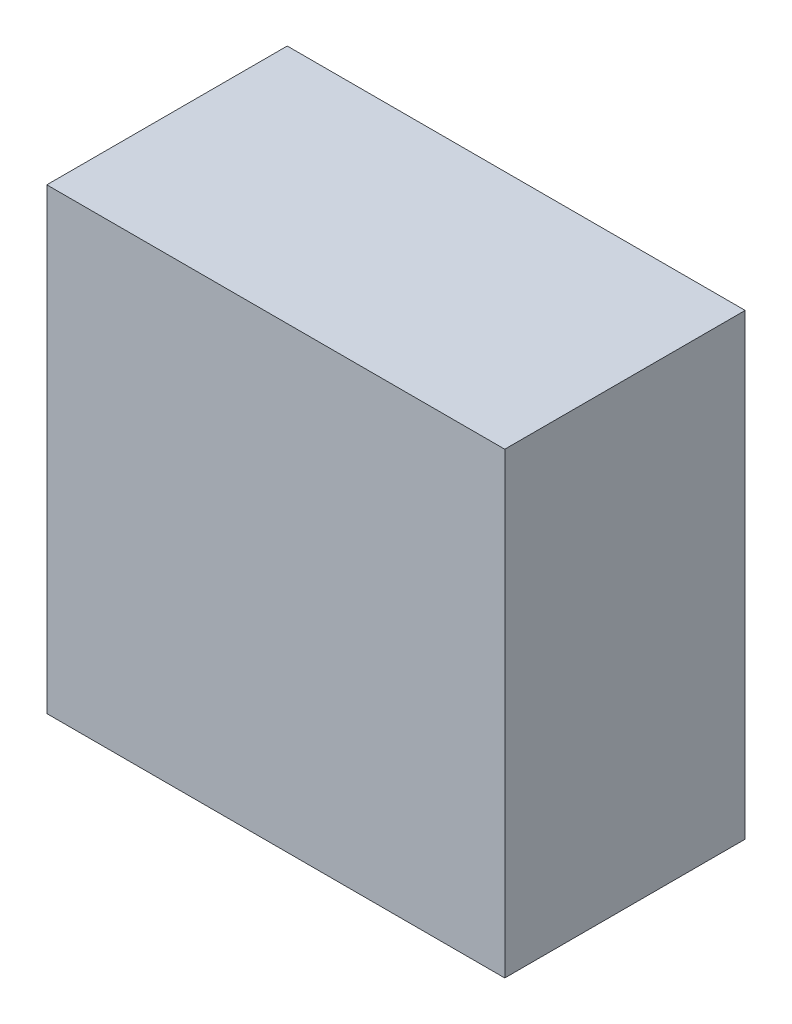
ISO-10303-21;
HEADER;
FILE_DESCRIPTION(('STEP AP214'),'2;1');
FILE_NAME('part.step','',(''),(''),'','','');
FILE_SCHEMA(('AUTOMOTIVE_DESIGN { 1 0 10303 214 1 1 1 1 }'));
ENDSEC;
DATA;
#1=APPLICATION_CONTEXT('core data for automotive mechanical design processes');
#2=APPLICATION_PROTOCOL_DEFINITION('international standard','automotive_design',2000,#1);
#3=PRODUCT_CONTEXT('',#1,'mechanical');
#4=PRODUCT('Part','Part','',(#3));
#5=PRODUCT_RELATED_PRODUCT_CATEGORY('part','',(#4));
#6=PRODUCT_DEFINITION_FORMATION('','',#4);
#7=PRODUCT_DEFINITION_CONTEXT('part definition',#1,'design');
#8=PRODUCT_DEFINITION('design','',#6,#7);
#9=PRODUCT_DEFINITION_SHAPE('','',#8);
#10=(LENGTH_UNIT() NAMED_UNIT(*) SI_UNIT(.MILLI.,.METRE.));
#11=(NAMED_UNIT(*) PLANE_ANGLE_UNIT() SI_UNIT($,.RADIAN.));
#12=(NAMED_UNIT(*) SI_UNIT($,.STERADIAN.) SOLID_ANGLE_UNIT());
#13=UNCERTAINTY_MEASURE_WITH_UNIT(LENGTH_MEASURE(1.E-05),#10,'distance_accuracy_value','');
#14=(GEOMETRIC_REPRESENTATION_CONTEXT(3) GLOBAL_UNCERTAINTY_ASSIGNED_CONTEXT((#13)) GLOBAL_UNIT_ASSIGNED_CONTEXT((#10,
#11,#12)) REPRESENTATION_CONTEXT('',''));
#15=CARTESIAN_POINT('',(0.,0.,0.));
#16=DIRECTION('',(0.,0.,1.));
#17=DIRECTION('',(1.,0.,0.));
#18=AXIS2_PLACEMENT_3D('',#15,#16,#17);
#19=CARTESIAN_POINT('',(2.00000108,-2.00000108,2.10000088));
#20=DIRECTION('',(0.,0.,-1.));
#21=DIRECTION('',(-1.,0.,0.));
#22=AXIS2_PLACEMENT_3D('',#19,#20,#21);
#23=PLANE('',#22);
#24=DIRECTION('',(1.,0.,0.));
#25=VECTOR('',#24,1.);
#26=CARTESIAN_POINT('',(2.00000108,2.00000108,2.10000088));
#27=LINE('',#26,#25);
#28=CARTESIAN_POINT('',(2.00000108,2.00000108,2.10000088));
#29=VERTEX_POINT('',#28);
#30=CARTESIAN_POINT('',(-2.00000108,2.00000108,2.10000088));
#31=VERTEX_POINT('',#30);
#32=EDGE_CURVE('E55',#29,#31,#27,.F.);
#33=ORIENTED_EDGE('',*,*,#32,.T.);
#34=DIRECTION('',(0.,1.,0.));
#35=VECTOR('',#34,1.);
#36=CARTESIAN_POINT('',(-2.00000108,2.00000108,2.10000088));
#37=LINE('',#36,#35);
#38=CARTESIAN_POINT('',(-2.00000108,-2.00000108,2.10000088));
#39=VERTEX_POINT('',#38);
#40=EDGE_CURVE('E57',#31,#39,#37,.F.);
#41=ORIENTED_EDGE('',*,*,#40,.T.);
#42=DIRECTION('',(1.,0.,0.));
#43=VECTOR('',#42,1.);
#44=CARTESIAN_POINT('',(-2.00000108,-2.00000108,2.10000088));
#45=LINE('',#44,#43);
#46=CARTESIAN_POINT('',(2.00000108,-2.00000108,2.10000088));
#47=VERTEX_POINT('',#46);
#48=EDGE_CURVE('E20',#39,#47,#45,.T.);
#49=ORIENTED_EDGE('',*,*,#48,.T.);
#50=DIRECTION('',(0.,1.,0.));
#51=VECTOR('',#50,1.);
#52=CARTESIAN_POINT('',(2.00000108,-2.00000108,2.10000088));
#53=LINE('',#52,#51);
#54=EDGE_CURVE('E80',#47,#29,#53,.T.);
#55=ORIENTED_EDGE('',*,*,#54,.T.);
#56=EDGE_LOOP('',(#33,#41,#49,#55));
#57=FACE_BOUND('',#56,.T.);
#58=ADVANCED_FACE('F17',(#57),#23,.F.);
#59=CARTESIAN_POINT('',(-2.00000108,-2.00000108,0.));
#60=DIRECTION('',(0.,1.,0.));
#61=DIRECTION('',(0.,0.,1.));
#62=AXIS2_PLACEMENT_3D('',#59,#60,#61);
#63=PLANE('',#62);
#64=DIRECTION('',(0.,0.,1.));
#65=VECTOR('',#64,1.);
#66=CARTESIAN_POINT('',(2.00000108,-2.00000108,0.));
#67=LINE('',#66,#65);
#68=CARTESIAN_POINT('',(2.00000108,-2.00000108,0.));
#69=VERTEX_POINT('',#68);
#70=EDGE_CURVE('E68',#69,#47,#67,.T.);
#71=ORIENTED_EDGE('',*,*,#70,.T.);
#72=ORIENTED_EDGE('',*,*,#48,.F.);
#73=DIRECTION('',(0.,0.,-1.));
#74=VECTOR('',#73,1.);
#75=CARTESIAN_POINT('',(-2.00000108,-2.00000108,0.));
#76=LINE('',#75,#74);
#77=CARTESIAN_POINT('',(-2.00000108,-2.00000108,0.));
#78=VERTEX_POINT('',#77);
#79=EDGE_CURVE('E63',#39,#78,#76,.T.);
#80=ORIENTED_EDGE('',*,*,#79,.T.);
#81=DIRECTION('',(-1.,0.,0.));
#82=VECTOR('',#81,1.);
#83=CARTESIAN_POINT('',(2.00000108,-2.00000108,0.));
#84=LINE('',#83,#82);
#85=EDGE_CURVE('E83',#69,#78,#84,.T.);
#86=ORIENTED_EDGE('',*,*,#85,.F.);
#87=EDGE_LOOP('',(#71,#72,#80,#86));
#88=FACE_BOUND('',#87,.T.);
#89=ADVANCED_FACE('F65',(#88),#63,.F.);
#90=CARTESIAN_POINT('',(-2.00000108,2.00000108,0.));
#91=DIRECTION('',(1.,0.,0.));
#92=DIRECTION('',(0.,0.,-1.));
#93=AXIS2_PLACEMENT_3D('',#90,#91,#92);
#94=PLANE('',#93);
#95=ORIENTED_EDGE('',*,*,#79,.F.);
#96=ORIENTED_EDGE('',*,*,#40,.F.);
#97=DIRECTION('',(0.,0.,-1.));
#98=VECTOR('',#97,1.);
#99=CARTESIAN_POINT('',(-2.00000108,2.00000108,0.));
#100=LINE('',#99,#98);
#101=CARTESIAN_POINT('',(-2.00000108,2.00000108,0.));
#102=VERTEX_POINT('',#101);
#103=EDGE_CURVE('E75',#31,#102,#100,.T.);
#104=ORIENTED_EDGE('',*,*,#103,.T.);
#105=DIRECTION('',(0.,1.,0.));
#106=VECTOR('',#105,1.);
#107=CARTESIAN_POINT('',(-2.00000108,-2.00000108,0.));
#108=LINE('',#107,#106);
#109=EDGE_CURVE('E72',#78,#102,#108,.T.);
#110=ORIENTED_EDGE('',*,*,#109,.F.);
#111=EDGE_LOOP('',(#95,#96,#104,#110));
#112=FACE_BOUND('',#111,.T.);
#113=ADVANCED_FACE('F70',(#112),#94,.F.);
#114=CARTESIAN_POINT('',(2.00000108,2.00000108,0.));
#115=DIRECTION('',(0.,-1.,0.));
#116=DIRECTION('',(0.,0.,-1.));
#117=AXIS2_PLACEMENT_3D('',#114,#115,#116);
#118=PLANE('',#117);
#119=ORIENTED_EDGE('',*,*,#103,.F.);
#120=ORIENTED_EDGE('',*,*,#32,.F.);
#121=DIRECTION('',(0.,0.,1.));
#122=VECTOR('',#121,1.);
#123=CARTESIAN_POINT('',(2.00000108,2.00000108,0.));
#124=LINE('',#123,#122);
#125=CARTESIAN_POINT('',(2.00000108,2.00000108,0.));
#126=VERTEX_POINT('',#125);
#127=EDGE_CURVE('E35',#29,#126,#124,.F.);
#128=ORIENTED_EDGE('',*,*,#127,.T.);
#129=DIRECTION('',(-1.,0.,0.));
#130=VECTOR('',#129,1.);
#131=CARTESIAN_POINT('',(2.00000108,2.00000108,0.));
#132=LINE('',#131,#130);
#133=EDGE_CURVE('E26',#102,#126,#132,.F.);
#134=ORIENTED_EDGE('',*,*,#133,.F.);
#135=EDGE_LOOP('',(#119,#120,#128,#134));
#136=FACE_BOUND('',#135,.T.);
#137=ADVANCED_FACE('F89',(#136),#118,.F.);
#138=CARTESIAN_POINT('',(2.00000108,-2.00000108,0.));
#139=DIRECTION('',(-1.,0.,0.));
#140=DIRECTION('',(0.,0.,1.));
#141=AXIS2_PLACEMENT_3D('',#138,#139,#140);
#142=PLANE('',#141);
#143=ORIENTED_EDGE('',*,*,#127,.F.);
#144=ORIENTED_EDGE('',*,*,#54,.F.);
#145=ORIENTED_EDGE('',*,*,#70,.F.);
#146=DIRECTION('',(0.,1.,0.));
#147=VECTOR('',#146,1.);
#148=CARTESIAN_POINT('',(2.00000108,-2.00000108,0.));
#149=LINE('',#148,#147);
#150=EDGE_CURVE('E11',#126,#69,#149,.F.);
#151=ORIENTED_EDGE('',*,*,#150,.F.);
#152=EDGE_LOOP('',(#143,#144,#145,#151));
#153=FACE_BOUND('',#152,.T.);
#154=ADVANCED_FACE('F91',(#153),#142,.F.);
#155=CARTESIAN_POINT('',(2.00000108,-2.00000108,0.));
#156=DIRECTION('',(0.,0.,-1.));
#157=DIRECTION('',(-1.,0.,0.));
#158=AXIS2_PLACEMENT_3D('',#155,#156,#157);
#159=PLANE('',#158);
#160=ORIENTED_EDGE('',*,*,#133,.T.);
#161=ORIENTED_EDGE('',*,*,#150,.T.);
#162=ORIENTED_EDGE('',*,*,#85,.T.);
#163=ORIENTED_EDGE('',*,*,#109,.T.);
#164=EDGE_LOOP('',(#160,#161,#162,#163));
#165=FACE_BOUND('',#164,.T.);
#166=ADVANCED_FACE('F88',(#165),#159,.T.);
#167=CLOSED_SHELL('',(#58,#89,#113,#137,#154,#166));
#168=MANIFOLD_SOLID_BREP('B1',#167);
#169=ADVANCED_BREP_SHAPE_REPRESENTATION('',(#18,#168),#14);
#170=SHAPE_DEFINITION_REPRESENTATION(#9,#169);
ENDSEC;
END-ISO-10303-21;
